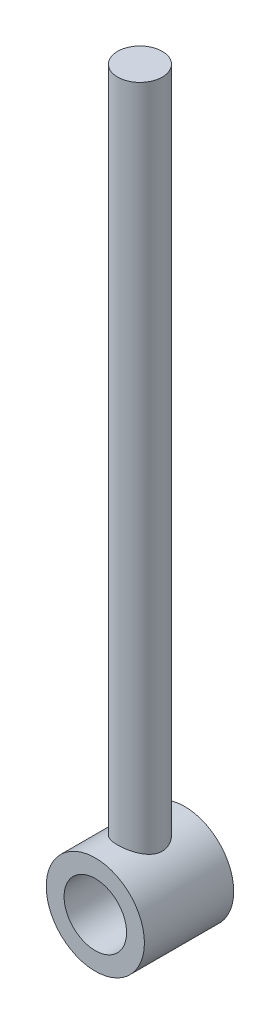
ISO-10303-21;
HEADER;
FILE_DESCRIPTION(('STEP AP214'),'2;1');
FILE_NAME('part.step','',(''),(''),'','','');
FILE_SCHEMA(('AUTOMOTIVE_DESIGN { 1 0 10303 214 1 1 1 1 }'));
ENDSEC;
DATA;
#1=APPLICATION_CONTEXT('core data for automotive mechanical design processes');
#2=APPLICATION_PROTOCOL_DEFINITION('international standard','automotive_design',2000,#1);
#3=PRODUCT_CONTEXT('',#1,'mechanical');
#4=PRODUCT('Part','Part','',(#3));
#5=PRODUCT_RELATED_PRODUCT_CATEGORY('part','',(#4));
#6=PRODUCT_DEFINITION_FORMATION('','',#4);
#7=PRODUCT_DEFINITION_CONTEXT('part definition',#1,'design');
#8=PRODUCT_DEFINITION('design','',#6,#7);
#9=PRODUCT_DEFINITION_SHAPE('','',#8);
#10=(LENGTH_UNIT() NAMED_UNIT(*) SI_UNIT(.MILLI.,.METRE.));
#11=(NAMED_UNIT(*) PLANE_ANGLE_UNIT() SI_UNIT($,.RADIAN.));
#12=(NAMED_UNIT(*) SI_UNIT($,.STERADIAN.) SOLID_ANGLE_UNIT());
#13=UNCERTAINTY_MEASURE_WITH_UNIT(LENGTH_MEASURE(1.E-05),#10,'distance_accuracy_value','');
#14=(GEOMETRIC_REPRESENTATION_CONTEXT(3) GLOBAL_UNCERTAINTY_ASSIGNED_CONTEXT((#13)) GLOBAL_UNIT_ASSIGNED_CONTEXT((#10,
#11,#12)) REPRESENTATION_CONTEXT('',''));
#15=CARTESIAN_POINT('',(0.,0.,0.));
#16=DIRECTION('',(0.,0.,1.));
#17=DIRECTION('',(1.,0.,0.));
#18=AXIS2_PLACEMENT_3D('',#15,#16,#17);
#19=CARTESIAN_POINT('',(0.,0.,10.));
#20=DIRECTION('',(0.,0.,-1.));
#21=DIRECTION('',(-1.,0.,0.));
#22=AXIS2_PLACEMENT_3D('',#19,#20,#21);
#23=CYLINDRICAL_SURFACE('',#22,5.5);
#24=CARTESIAN_POINT('',(0.,0.,10.));
#25=DIRECTION('',(0.,0.,1.));
#26=DIRECTION('',(1.,0.,0.));
#27=AXIS2_PLACEMENT_3D('',#24,#25,#26);
#28=CIRCLE('',#27,5.5);
#29=CARTESIAN_POINT('',(5.5,0.,10.));
#30=VERTEX_POINT('',#29);
#31=EDGE_CURVE('E45',#30,#30,#28,.T.);
#32=ORIENTED_EDGE('',*,*,#31,.F.);
#33=EDGE_LOOP('',(#32));
#34=FACE_BOUND('',#33,.T.);
#35=CARTESIAN_POINT('',(0.,0.,0.));
#36=DIRECTION('',(0.,0.,1.));
#37=DIRECTION('',(1.,0.,0.));
#38=AXIS2_PLACEMENT_3D('',#35,#36,#37);
#39=CIRCLE('',#38,5.5);
#40=CARTESIAN_POINT('',(5.5,0.,0.));
#41=VERTEX_POINT('',#40);
#42=EDGE_CURVE('E40',#41,#41,#39,.T.);
#43=ORIENTED_EDGE('',*,*,#42,.T.);
#44=EDGE_LOOP('',(#43));
#45=FACE_BOUND('',#44,.T.);
#46=CARTESIAN_POINT('',(0.,5.5,2.5));
#47=CARTESIAN_POINT('',(-0.132816145284357,5.49999369870931,2.50000770657968));
#48=CARTESIAN_POINT('',(-0.265835701448803,5.49513526114601,2.51064708851472));
#49=CARTESIAN_POINT('',(-0.528027896062537,5.47618102046917,2.55277708585043));
#50=CARTESIAN_POINT('',(-0.657190881556424,5.46206378775658,2.58431607542101));
#51=CARTESIAN_POINT('',(-0.907466739557298,5.42608787981103,2.66680544715223));
#52=CARTESIAN_POINT('',(-1.02860698228922,5.40425732698846,2.71768536363404));
#53=CARTESIAN_POINT('',(-1.26049169700434,5.35492606344154,2.83708941935535));
#54=CARTESIAN_POINT('',(-1.37123824747009,5.32742648991282,2.90561002058932));
#55=CARTESIAN_POINT('',(-1.58575279564469,5.26767788661504,3.06248592473316));
#56=CARTESIAN_POINT('',(-1.68884771841108,5.23525516065229,3.15169467760791));
#57=CARTESIAN_POINT('',(-1.87921167122033,5.169981608249,3.34559891012303));
#58=CARTESIAN_POINT('',(-1.96647083094001,5.13713052839629,3.45030397520704));
#59=CARTESIAN_POINT('',(-2.12798843737884,5.07244492450594,3.6799449421281));
#60=CARTESIAN_POINT('',(-2.20112759491811,5.04079497957299,3.80572580705089));
#61=CARTESIAN_POINT('',(-2.32491325493927,4.98491966737432,4.06943201918799));
#62=CARTESIAN_POINT('',(-2.37557345021863,4.96068978306032,4.20734991174338));
#63=CARTESIAN_POINT('',(-2.45005627758752,4.9243140427224,4.48369548563305));
#64=CARTESIAN_POINT('',(-2.47518302941619,4.91158514421169,4.62169158073497));
#65=CARTESIAN_POINT('',(-2.50193279260797,4.89801821463239,4.90048194541598));
#66=CARTESIAN_POINT('',(-2.50357264087074,4.89717166555205,5.04127413806362));
#67=CARTESIAN_POINT('',(-2.48427141198996,4.90698153027191,5.30741072026334));
#68=CARTESIAN_POINT('',(-2.46545016283118,4.91655818122591,5.43295732955884));
#69=CARTESIAN_POINT('',(-2.4093676508794,4.94428109958009,5.6788660765093));
#70=CARTESIAN_POINT('',(-2.37210198697065,4.96242941226084,5.79922696931906));
#71=CARTESIAN_POINT('',(-2.27945184779561,5.0056720821879,6.03463657988821));
#72=CARTESIAN_POINT('',(-2.22367420519436,5.03091516285485,6.14950198601082));
#73=CARTESIAN_POINT('',(-2.09586859273949,5.08548488907163,6.3687414552682));
#74=CARTESIAN_POINT('',(-2.02383365211919,5.11481328424216,6.47311099017509));
#75=CARTESIAN_POINT('',(-1.85692478057703,5.17789221587211,6.67964656522397));
#76=CARTESIAN_POINT('',(-1.76046753299936,5.2117880598316,6.78049273353465));
#77=CARTESIAN_POINT('',(-1.55174815249174,5.27769368397502,6.96506827328681));
#78=CARTESIAN_POINT('',(-1.43948082103431,5.30970283886444,7.04879199238651));
#79=CARTESIAN_POINT('',(-1.19766281925566,5.36950534618767,7.19920668395963));
#80=CARTESIAN_POINT('',(-1.06767206685173,5.39712978524095,7.26526247902372));
#81=CARTESIAN_POINT('',(-0.796844896081458,5.44369936052484,7.37408839587899));
#82=CARTESIAN_POINT('',(-0.656015701378205,5.46265022004357,7.41687387617979));
#83=CARTESIAN_POINT('',(-0.378449914355492,5.48860490400602,7.47495536936345));
#84=CARTESIAN_POINT('',(-0.242154484202898,5.49637394767751,7.49201639920862));
#85=CARTESIAN_POINT('',(0.0315660436282488,5.50161007334277,7.50354688446092));
#86=CARTESIAN_POINT('',(0.168990715716221,5.49908087348691,7.49802449354217));
#87=CARTESIAN_POINT('',(0.432146778493067,5.48448407938737,7.4657141909571));
#88=CARTESIAN_POINT('',(0.558078127396233,5.47301153257062,7.44025247846056));
#89=CARTESIAN_POINT('',(0.803693463481533,5.44237110560927,7.37073267387439));
#90=CARTESIAN_POINT('',(0.923376701955515,5.42320230560714,7.32667235884421));
#91=CARTESIAN_POINT('',(1.15732747516372,5.37821815950354,7.21983025191788));
#92=CARTESIAN_POINT('',(1.27131180951637,5.35221506502489,7.15651006512357));
#93=CARTESIAN_POINT('',(1.48744614928834,5.29622400098564,7.013532445334));
#94=CARTESIAN_POINT('',(1.58959093424205,5.26623428600456,6.93386784808692));
#95=CARTESIAN_POINT('',(1.78819128612951,5.2023213866395,6.75268934687502));
#96=CARTESIAN_POINT('',(1.88345063650186,5.16827928194194,6.64990310925036));
#97=CARTESIAN_POINT('',(2.05579555974773,5.10218027178943,6.42943763375986));
#98=CARTESIAN_POINT('',(2.13287371467411,5.0701241805496,6.31175234705524));
#99=CARTESIAN_POINT('',(2.26851417742739,5.01093675854131,6.06054583116627));
#100=CARTESIAN_POINT('',(2.32651178086012,4.98396428661225,5.92667925579803));
#101=CARTESIAN_POINT('',(2.41857144488097,4.93995555801825,5.6494505865758));
#102=CARTESIAN_POINT('',(2.45265831910444,4.9229090037493,5.50609850603875));
#103=CARTESIAN_POINT('',(2.49325807507769,4.90246200756536,5.2274373803254));
#104=CARTESIAN_POINT('',(2.5019188531559,4.89799994349808,5.09251907739777));
#105=CARTESIAN_POINT('',(2.49737021161822,4.90032179261342,4.82316690852988));
#106=CARTESIAN_POINT('',(2.48416607010203,4.90710299172004,4.68873293352526));
#107=CARTESIAN_POINT('',(2.4381684933062,4.93010341873286,4.43337370386282));
#108=CARTESIAN_POINT('',(2.40671995185147,4.94567287009982,4.31214138124329));
#109=CARTESIAN_POINT('',(2.32658661605855,4.98386936157557,4.07670718572974));
#110=CARTESIAN_POINT('',(2.2778967772596,5.00649846696794,3.96250738190245));
#111=CARTESIAN_POINT('',(2.1610419547488,5.05808484439916,3.73621296097084));
#112=CARTESIAN_POINT('',(2.09181431853015,5.08735847849273,3.62474088289736));
#113=CARTESIAN_POINT('',(1.93719380028804,5.14822130854099,3.41433129072047));
#114=CARTESIAN_POINT('',(1.85179378769227,5.17981152212113,3.31539933793318));
#115=CARTESIAN_POINT('',(1.65784520472974,5.2452790147138,3.12333979866508));
#116=CARTESIAN_POINT('',(1.54788097332246,5.27909503785502,3.03161259442945));
#117=CARTESIAN_POINT('',(1.31300676588176,5.34236067072088,2.86773851077349));
#118=CARTESIAN_POINT('',(1.18808990453652,5.3718082548044,2.79560070214091));
#119=CARTESIAN_POINT('',(0.927398695048436,5.42285296457391,2.67397870975514));
#120=CARTESIAN_POINT('',(0.791729654695489,5.44451694348196,2.6243006157715));
#121=CARTESIAN_POINT('',(0.582817222347262,5.46948623676269,2.56781082539488));
#122=CARTESIAN_POINT('',(0.512336727590824,5.4765522405717,2.55199091419621));
#123=CARTESIAN_POINT('',(0.370074071775207,5.48799750884364,2.52648988951803));
#124=CARTESIAN_POINT('',(0.298292830256239,5.49237860050235,2.51680460101854));
#125=CARTESIAN_POINT('',(0.18861229497853,5.49689395714262,2.50683913684737));
#126=CARTESIAN_POINT('',(0.150946407387661,5.49805724033138,2.50427613909589));
#127=CARTESIAN_POINT('',(0.0755258311084194,5.49961116371431,2.50085546170958));
#128=CARTESIAN_POINT('',(0.0377711410607123,5.50000179200306,2.49999780835148));
#129=CARTESIAN_POINT('',(0.,5.5,2.5));
#130=B_SPLINE_CURVE_WITH_KNOTS('',3,(#46,#47,#48,#49,#50,#51,#52,#53,#54,#55,#56,#57,#58,#59,
#60,#61,#62,#63,#64,#65,#66,#67,#68,#69,#70,#71,#72,#73,#74,#75,#76,#77,#78,#79,#80,#81,#82,#83,
#84,#85,#86,#87,#88,#89,#90,#91,#92,#93,#94,#95,#96,#97,#98,#99,#100,#101,#102,#103,#104,#105,
#106,#107,#108,#109,#110,#111,#112,#113,#114,#115,#116,#117,#118,#119,#120,#121,#122,#123,#124,
#125,#126,#127,#128,#129),.UNSPECIFIED.,.T.,.F.,(4,2,2,2,2,2,2,2,2,2,2,2,2,2,2,2,2,2,2,2,2,2,2,
2,2,2,2,2,2,2,2,2,2,2,2,2,2,2,2,2,2,4),(0.,0.398300931001202,0.797527003400661,1.19531228574912,
1.59301785057736,2.01163405819865,2.43051029696777,2.8749655137827,3.31914962297436,
3.73929338084823,4.15913593798615,4.53929253779887,4.91953989247825,5.30844370198958,
5.6975145826618,6.1264236824533,6.55547414294633,6.99833839939004,7.44091000768855,
7.85145915894037,8.26186009578161,8.6470684559661,9.03232287003282,9.42952911220836,
9.8269098353609,10.2576285831247,10.6885227618009,11.1312140224167,11.5734451926766,
11.9770599127743,12.3805772161773,12.7575667492601,13.1346666732434,13.5363493613727,
13.9382095697602,14.3775242869152,14.8170420813821,15.2526891454276,15.4701654657451,
15.6874936194379,15.800763348909,15.9140348236778),.UNSPECIFIED.);
#131=CARTESIAN_POINT('',(0.,5.5,2.5));
#132=VERTEX_POINT('',#131);
#133=EDGE_CURVE('E10',#132,#132,#130,.T.);
#134=ORIENTED_EDGE('',*,*,#133,.F.);
#135=EDGE_LOOP('',(#134));
#136=FACE_BOUND('',#135,.T.);
#137=ADVANCED_FACE('F36',(#34,#45,#136),#23,.T.);
#138=CARTESIAN_POINT('',(0.,0.,10.));
#139=DIRECTION('',(0.,0.,-1.));
#140=DIRECTION('',(-1.,0.,0.));
#141=AXIS2_PLACEMENT_3D('',#138,#139,#140);
#142=CYLINDRICAL_SURFACE('',#141,3.5);
#143=CARTESIAN_POINT('',(0.,0.,0.));
#144=DIRECTION('',(0.,0.,1.));
#145=DIRECTION('',(1.,0.,0.));
#146=AXIS2_PLACEMENT_3D('',#143,#144,#145);
#147=CIRCLE('',#146,3.5);
#148=CARTESIAN_POINT('',(3.5,0.,0.));
#149=VERTEX_POINT('',#148);
#150=EDGE_CURVE('E92',#149,#149,#147,.T.);
#151=ORIENTED_EDGE('',*,*,#150,.F.);
#152=EDGE_LOOP('',(#151));
#153=FACE_BOUND('',#152,.T.);
#154=CARTESIAN_POINT('',(0.,0.,10.));
#155=DIRECTION('',(0.,0.,1.));
#156=DIRECTION('',(1.,0.,0.));
#157=AXIS2_PLACEMENT_3D('',#154,#155,#156);
#158=CIRCLE('',#157,3.5);
#159=CARTESIAN_POINT('',(3.5,0.,10.));
#160=VERTEX_POINT('',#159);
#161=EDGE_CURVE('E58',#160,#160,#158,.T.);
#162=ORIENTED_EDGE('',*,*,#161,.T.);
#163=EDGE_LOOP('',(#162));
#164=FACE_BOUND('',#163,.T.);
#165=ADVANCED_FACE('F68',(#153,#164),#142,.F.);
#166=CARTESIAN_POINT('',(0.,0.,10.));
#167=DIRECTION('',(0.,0.,1.));
#168=DIRECTION('',(1.,0.,0.));
#169=AXIS2_PLACEMENT_3D('',#166,#167,#168);
#170=PLANE('',#169);
#171=ORIENTED_EDGE('',*,*,#31,.T.);
#172=EDGE_LOOP('',(#171));
#173=FACE_BOUND('',#172,.T.);
#174=ORIENTED_EDGE('',*,*,#161,.F.);
#175=EDGE_LOOP('',(#174));
#176=FACE_BOUND('',#175,.T.);
#177=ADVANCED_FACE('F71',(#173,#176),#170,.T.);
#178=CARTESIAN_POINT('',(0.,0.,0.));
#179=DIRECTION('',(0.,0.,1.));
#180=DIRECTION('',(1.,0.,0.));
#181=AXIS2_PLACEMENT_3D('',#178,#179,#180);
#182=PLANE('',#181);
#183=ORIENTED_EDGE('',*,*,#42,.F.);
#184=EDGE_LOOP('',(#183));
#185=FACE_BOUND('',#184,.T.);
#186=ORIENTED_EDGE('',*,*,#150,.T.);
#187=EDGE_LOOP('',(#186));
#188=FACE_BOUND('',#187,.T.);
#189=ADVANCED_FACE('F66',(#185,#188),#182,.F.);
#190=CARTESIAN_POINT('',(0.,80.,5.));
#191=DIRECTION('',(0.,-1.,0.));
#192=DIRECTION('',(0.,0.,-1.));
#193=AXIS2_PLACEMENT_3D('',#190,#191,#192);
#194=CYLINDRICAL_SURFACE('',#193,2.5);
#195=CARTESIAN_POINT('',(0.,80.,5.));
#196=DIRECTION('',(0.,1.,0.));
#197=DIRECTION('',(0.,0.,1.));
#198=AXIS2_PLACEMENT_3D('',#195,#196,#197);
#199=CIRCLE('',#198,2.5);
#200=CARTESIAN_POINT('',(0.,80.,7.5));
#201=VERTEX_POINT('',#200);
#202=EDGE_CURVE('E57',#201,#201,#199,.T.);
#203=ORIENTED_EDGE('',*,*,#202,.F.);
#204=EDGE_LOOP('',(#203));
#205=FACE_BOUND('',#204,.T.);
#206=ORIENTED_EDGE('',*,*,#133,.T.);
#207=EDGE_LOOP('',(#206));
#208=FACE_BOUND('',#207,.T.);
#209=ADVANCED_FACE('F60',(#205,#208),#194,.T.);
#210=CARTESIAN_POINT('',(0.,80.,5.));
#211=DIRECTION('',(0.,1.,0.));
#212=DIRECTION('',(0.,0.,1.));
#213=AXIS2_PLACEMENT_3D('',#210,#211,#212);
#214=PLANE('',#213);
#215=ORIENTED_EDGE('',*,*,#202,.T.);
#216=EDGE_LOOP('',(#215));
#217=FACE_BOUND('',#216,.T.);
#218=ADVANCED_FACE('F65',(#217),#214,.T.);
#219=CLOSED_SHELL('',(#137,#165,#177,#189,#209,#218));
#220=MANIFOLD_SOLID_BREP('B2',#219);
#221=ADVANCED_BREP_SHAPE_REPRESENTATION('',(#18,#220),#14);
#222=SHAPE_DEFINITION_REPRESENTATION(#9,#221);
ENDSEC;
END-ISO-10303-21;
